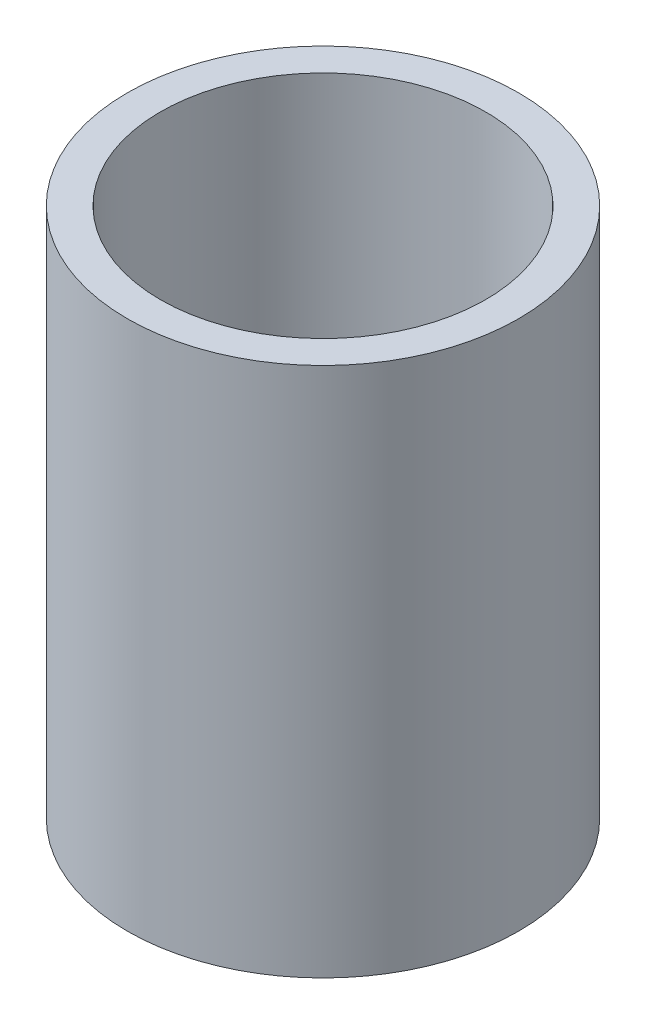
ISO-10303-21;
HEADER;
FILE_DESCRIPTION(('STEP AP214'),'2;1');
FILE_NAME('part.step','',(''),(''),'','','');
FILE_SCHEMA(('AUTOMOTIVE_DESIGN { 1 0 10303 214 1 1 1 1 }'));
ENDSEC;
DATA;
#1=APPLICATION_CONTEXT('core data for automotive mechanical design processes');
#2=APPLICATION_PROTOCOL_DEFINITION('international standard','automotive_design',2000,#1);
#3=PRODUCT_CONTEXT('',#1,'mechanical');
#4=PRODUCT('Part','Part','',(#3));
#5=PRODUCT_RELATED_PRODUCT_CATEGORY('part','',(#4));
#6=PRODUCT_DEFINITION_FORMATION('','',#4);
#7=PRODUCT_DEFINITION_CONTEXT('part definition',#1,'design');
#8=PRODUCT_DEFINITION('design','',#6,#7);
#9=PRODUCT_DEFINITION_SHAPE('','',#8);
#10=(LENGTH_UNIT() NAMED_UNIT(*) SI_UNIT(.MILLI.,.METRE.));
#11=(NAMED_UNIT(*) PLANE_ANGLE_UNIT() SI_UNIT($,.RADIAN.));
#12=(NAMED_UNIT(*) SI_UNIT($,.STERADIAN.) SOLID_ANGLE_UNIT());
#13=UNCERTAINTY_MEASURE_WITH_UNIT(LENGTH_MEASURE(1.E-05),#10,'distance_accuracy_value','');
#14=(GEOMETRIC_REPRESENTATION_CONTEXT(3) GLOBAL_UNCERTAINTY_ASSIGNED_CONTEXT((#13)) GLOBAL_UNIT_ASSIGNED_CONTEXT((#10,
#11,#12)) REPRESENTATION_CONTEXT('',''));
#15=CARTESIAN_POINT('',(0.,0.,0.));
#16=DIRECTION('',(0.,0.,1.));
#17=DIRECTION('',(1.,0.,0.));
#18=AXIS2_PLACEMENT_3D('',#15,#16,#17);
#19=CARTESIAN_POINT('',(0.,57.15,0.));
#20=DIRECTION('',(0.,1.,0.));
#21=DIRECTION('',(0.,0.,1.));
#22=AXIS2_PLACEMENT_3D('',#19,#20,#21);
#23=PLANE('',#22);
#24=CARTESIAN_POINT('',(0.,57.15,0.));
#25=DIRECTION('',(0.,1.,0.));
#26=DIRECTION('',(0.,0.,1.));
#27=AXIS2_PLACEMENT_3D('',#24,#25,#26);
#28=CIRCLE('',#27,21.082);
#29=CARTESIAN_POINT('',(0.,57.15,21.082));
#30=VERTEX_POINT('',#29);
#31=EDGE_CURVE('E10',#30,#30,#28,.T.);
#32=ORIENTED_EDGE('',*,*,#31,.T.);
#33=EDGE_LOOP('',(#32));
#34=FACE_BOUND('',#33,.T.);
#35=CARTESIAN_POINT('',(0.,57.15,0.));
#36=DIRECTION('',(0.,1.,0.));
#37=DIRECTION('',(0.,0.,1.));
#38=AXIS2_PLACEMENT_3D('',#35,#36,#37);
#39=CIRCLE('',#38,17.526);
#40=CARTESIAN_POINT('',(0.,57.15,17.526));
#41=VERTEX_POINT('',#40);
#42=EDGE_CURVE('E43',#41,#41,#39,.T.);
#43=ORIENTED_EDGE('',*,*,#42,.F.);
#44=EDGE_LOOP('',(#43));
#45=FACE_BOUND('',#44,.T.);
#46=ADVANCED_FACE('F32',(#34,#45),#23,.T.);
#47=CARTESIAN_POINT('',(0.,0.,0.));
#48=DIRECTION('',(0.,1.,0.));
#49=DIRECTION('',(0.,0.,1.));
#50=AXIS2_PLACEMENT_3D('',#47,#48,#49);
#51=PLANE('',#50);
#52=CARTESIAN_POINT('',(0.,0.,0.));
#53=DIRECTION('',(0.,1.,0.));
#54=DIRECTION('',(0.,0.,1.));
#55=AXIS2_PLACEMENT_3D('',#52,#53,#54);
#56=CIRCLE('',#55,21.082);
#57=CARTESIAN_POINT('',(0.,0.,21.082));
#58=VERTEX_POINT('',#57);
#59=EDGE_CURVE('E36',#58,#58,#56,.T.);
#60=ORIENTED_EDGE('',*,*,#59,.F.);
#61=EDGE_LOOP('',(#60));
#62=FACE_BOUND('',#61,.T.);
#63=CARTESIAN_POINT('',(0.,0.,0.));
#64=DIRECTION('',(0.,1.,0.));
#65=DIRECTION('',(0.,0.,1.));
#66=AXIS2_PLACEMENT_3D('',#63,#64,#65);
#67=CIRCLE('',#66,17.526);
#68=CARTESIAN_POINT('',(0.,0.,17.526));
#69=VERTEX_POINT('',#68);
#70=EDGE_CURVE('E45',#69,#69,#67,.T.);
#71=ORIENTED_EDGE('',*,*,#70,.T.);
#72=EDGE_LOOP('',(#71));
#73=FACE_BOUND('',#72,.T.);
#74=ADVANCED_FACE('F55',(#62,#73),#51,.F.);
#75=CARTESIAN_POINT('',(0.,57.15,0.));
#76=DIRECTION('',(0.,-1.,0.));
#77=DIRECTION('',(0.,0.,-1.));
#78=AXIS2_PLACEMENT_3D('',#75,#76,#77);
#79=CYLINDRICAL_SURFACE('',#78,21.082);
#80=ORIENTED_EDGE('',*,*,#31,.F.);
#81=EDGE_LOOP('',(#80));
#82=FACE_BOUND('',#81,.T.);
#83=ORIENTED_EDGE('',*,*,#59,.T.);
#84=EDGE_LOOP('',(#83));
#85=FACE_BOUND('',#84,.T.);
#86=ADVANCED_FACE('F34',(#82,#85),#79,.T.);
#87=CARTESIAN_POINT('',(0.,57.15,0.));
#88=DIRECTION('',(0.,-1.,0.));
#89=DIRECTION('',(0.,0.,-1.));
#90=AXIS2_PLACEMENT_3D('',#87,#88,#89);
#91=CYLINDRICAL_SURFACE('',#90,17.526);
#92=ORIENTED_EDGE('',*,*,#42,.T.);
#93=EDGE_LOOP('',(#92));
#94=FACE_BOUND('',#93,.T.);
#95=ORIENTED_EDGE('',*,*,#70,.F.);
#96=EDGE_LOOP('',(#95));
#97=FACE_BOUND('',#96,.T.);
#98=ADVANCED_FACE('F51',(#94,#97),#91,.F.);
#99=CLOSED_SHELL('',(#46,#74,#86,#98));
#100=MANIFOLD_SOLID_BREP('B2',#99);
#101=ADVANCED_BREP_SHAPE_REPRESENTATION('',(#18,#100),#14);
#102=SHAPE_DEFINITION_REPRESENTATION(#9,#101);
ENDSEC;
END-ISO-10303-21;
